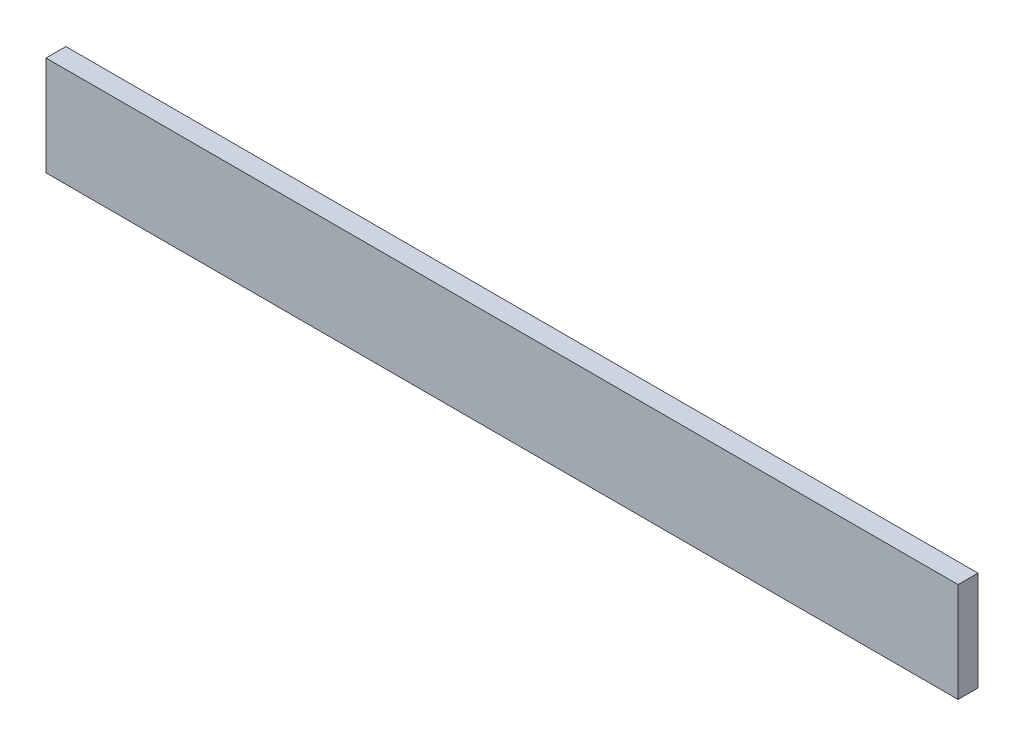
ISO-10303-21;
HEADER;
FILE_DESCRIPTION(('STEP AP214'),'2;1');
FILE_NAME('part.step','',(''),(''),'','','');
FILE_SCHEMA(('AUTOMOTIVE_DESIGN { 1 0 10303 214 1 1 1 1 }'));
ENDSEC;
DATA;
#1=APPLICATION_CONTEXT('core data for automotive mechanical design processes');
#2=APPLICATION_PROTOCOL_DEFINITION('international standard','automotive_design',2000,#1);
#3=PRODUCT_CONTEXT('',#1,'mechanical');
#4=PRODUCT('Part','Part','',(#3));
#5=PRODUCT_RELATED_PRODUCT_CATEGORY('part','',(#4));
#6=PRODUCT_DEFINITION_FORMATION('','',#4);
#7=PRODUCT_DEFINITION_CONTEXT('part definition',#1,'design');
#8=PRODUCT_DEFINITION('design','',#6,#7);
#9=PRODUCT_DEFINITION_SHAPE('','',#8);
#10=(LENGTH_UNIT() NAMED_UNIT(*) SI_UNIT(.MILLI.,.METRE.));
#11=(NAMED_UNIT(*) PLANE_ANGLE_UNIT() SI_UNIT($,.RADIAN.));
#12=(NAMED_UNIT(*) SI_UNIT($,.STERADIAN.) SOLID_ANGLE_UNIT());
#13=UNCERTAINTY_MEASURE_WITH_UNIT(LENGTH_MEASURE(1.E-05),#10,'distance_accuracy_value','');
#14=(GEOMETRIC_REPRESENTATION_CONTEXT(3) GLOBAL_UNCERTAINTY_ASSIGNED_CONTEXT((#13)) GLOBAL_UNIT_ASSIGNED_CONTEXT((#10,
#11,#12)) REPRESENTATION_CONTEXT('',''));
#15=CARTESIAN_POINT('',(0.,0.,0.));
#16=DIRECTION('',(0.,0.,1.));
#17=DIRECTION('',(1.,0.,0.));
#18=AXIS2_PLACEMENT_3D('',#15,#16,#17);
#19=CARTESIAN_POINT('',(0.,0.,10.));
#20=DIRECTION('',(1.,0.,0.));
#21=DIRECTION('',(0.,0.,-1.));
#22=AXIS2_PLACEMENT_3D('',#19,#20,#21);
#23=PLANE('',#22);
#24=DIRECTION('',(0.,-1.,0.));
#25=VECTOR('',#24,1.);
#26=CARTESIAN_POINT('',(0.,0.,0.));
#27=LINE('',#26,#25);
#28=CARTESIAN_POINT('',(0.,50.,0.));
#29=VERTEX_POINT('',#28);
#30=CARTESIAN_POINT('',(0.,0.,0.));
#31=VERTEX_POINT('',#30);
#32=EDGE_CURVE('E98',#29,#31,#27,.T.);
#33=ORIENTED_EDGE('',*,*,#32,.T.);
#34=DIRECTION('',(0.,0.,-1.));
#35=VECTOR('',#34,1.);
#36=CARTESIAN_POINT('',(0.,0.,10.));
#37=LINE('',#36,#35);
#38=CARTESIAN_POINT('',(0.,0.,10.));
#39=VERTEX_POINT('',#38);
#40=EDGE_CURVE('E11',#39,#31,#37,.T.);
#41=ORIENTED_EDGE('',*,*,#40,.F.);
#42=DIRECTION('',(0.,-1.,0.));
#43=VECTOR('',#42,1.);
#44=CARTESIAN_POINT('',(0.,0.,10.));
#45=LINE('',#44,#43);
#46=CARTESIAN_POINT('',(0.,50.,10.));
#47=VERTEX_POINT('',#46);
#48=EDGE_CURVE('E86',#47,#39,#45,.T.);
#49=ORIENTED_EDGE('',*,*,#48,.F.);
#50=DIRECTION('',(0.,0.,-1.));
#51=VECTOR('',#50,1.);
#52=CARTESIAN_POINT('',(0.,50.,10.));
#53=LINE('',#52,#51);
#54=EDGE_CURVE('E94',#47,#29,#53,.T.);
#55=ORIENTED_EDGE('',*,*,#54,.T.);
#56=EDGE_LOOP('',(#33,#41,#49,#55));
#57=FACE_BOUND('',#56,.T.);
#58=ADVANCED_FACE('F35',(#57),#23,.F.);
#59=CARTESIAN_POINT('',(0.,0.,10.));
#60=DIRECTION('',(0.,1.,0.));
#61=DIRECTION('',(0.,0.,1.));
#62=AXIS2_PLACEMENT_3D('',#59,#60,#61);
#63=PLANE('',#62);
#64=DIRECTION('',(1.,0.,0.));
#65=VECTOR('',#64,1.);
#66=CARTESIAN_POINT('',(0.,0.,0.));
#67=LINE('',#66,#65);
#68=CARTESIAN_POINT('',(458.407253025923,0.,0.));
#69=VERTEX_POINT('',#68);
#70=EDGE_CURVE('E90',#31,#69,#67,.T.);
#71=ORIENTED_EDGE('',*,*,#70,.T.);
#72=DIRECTION('',(0.,0.,-1.));
#73=VECTOR('',#72,1.);
#74=CARTESIAN_POINT('',(458.407253025923,0.,10.));
#75=LINE('',#74,#73);
#76=CARTESIAN_POINT('',(458.407253025923,0.,10.));
#77=VERTEX_POINT('',#76);
#78=EDGE_CURVE('E43',#77,#69,#75,.T.);
#79=ORIENTED_EDGE('',*,*,#78,.F.);
#80=DIRECTION('',(1.,0.,0.));
#81=VECTOR('',#80,1.);
#82=CARTESIAN_POINT('',(0.,0.,10.));
#83=LINE('',#82,#81);
#84=EDGE_CURVE('E81',#39,#77,#83,.T.);
#85=ORIENTED_EDGE('',*,*,#84,.F.);
#86=ORIENTED_EDGE('',*,*,#40,.T.);
#87=EDGE_LOOP('',(#71,#79,#85,#86));
#88=FACE_BOUND('',#87,.T.);
#89=ADVANCED_FACE('F89',(#88),#63,.F.);
#90=CARTESIAN_POINT('',(458.407253025923,0.,10.));
#91=DIRECTION('',(-1.,0.,0.));
#92=DIRECTION('',(0.,0.,1.));
#93=AXIS2_PLACEMENT_3D('',#90,#91,#92);
#94=PLANE('',#93);
#95=DIRECTION('',(0.,1.,0.));
#96=VECTOR('',#95,1.);
#97=CARTESIAN_POINT('',(458.407253025923,0.,0.));
#98=LINE('',#97,#96);
#99=CARTESIAN_POINT('',(458.407253025923,50.,0.));
#100=VERTEX_POINT('',#99);
#101=EDGE_CURVE('E68',#69,#100,#98,.T.);
#102=ORIENTED_EDGE('',*,*,#101,.T.);
#103=DIRECTION('',(0.,0.,-1.));
#104=VECTOR('',#103,1.);
#105=CARTESIAN_POINT('',(458.407253025923,50.,10.));
#106=LINE('',#105,#104);
#107=CARTESIAN_POINT('',(458.407253025923,50.,10.));
#108=VERTEX_POINT('',#107);
#109=EDGE_CURVE('E91',#108,#100,#106,.T.);
#110=ORIENTED_EDGE('',*,*,#109,.F.);
#111=DIRECTION('',(0.,1.,0.));
#112=VECTOR('',#111,1.);
#113=CARTESIAN_POINT('',(458.407253025923,0.,10.));
#114=LINE('',#113,#112);
#115=EDGE_CURVE('E84',#77,#108,#114,.T.);
#116=ORIENTED_EDGE('',*,*,#115,.F.);
#117=ORIENTED_EDGE('',*,*,#78,.T.);
#118=EDGE_LOOP('',(#102,#110,#116,#117));
#119=FACE_BOUND('',#118,.T.);
#120=ADVANCED_FACE('F92',(#119),#94,.F.);
#121=CARTESIAN_POINT('',(0.,50.,10.));
#122=DIRECTION('',(0.,-1.,0.));
#123=DIRECTION('',(0.,0.,-1.));
#124=AXIS2_PLACEMENT_3D('',#121,#122,#123);
#125=PLANE('',#124);
#126=DIRECTION('',(-1.,0.,0.));
#127=VECTOR('',#126,1.);
#128=CARTESIAN_POINT('',(0.,50.,0.));
#129=LINE('',#128,#127);
#130=EDGE_CURVE('E74',#100,#29,#129,.T.);
#131=ORIENTED_EDGE('',*,*,#130,.T.);
#132=ORIENTED_EDGE('',*,*,#54,.F.);
#133=DIRECTION('',(-1.,0.,0.));
#134=VECTOR('',#133,1.);
#135=CARTESIAN_POINT('',(0.,50.,10.));
#136=LINE('',#135,#134);
#137=EDGE_CURVE('E51',#108,#47,#136,.T.);
#138=ORIENTED_EDGE('',*,*,#137,.F.);
#139=ORIENTED_EDGE('',*,*,#109,.T.);
#140=EDGE_LOOP('',(#131,#132,#138,#139));
#141=FACE_BOUND('',#140,.T.);
#142=ADVANCED_FACE('F105',(#141),#125,.F.);
#143=CARTESIAN_POINT('',(0.,0.,10.));
#144=DIRECTION('',(0.,0.,-1.));
#145=DIRECTION('',(-1.,0.,0.));
#146=AXIS2_PLACEMENT_3D('',#143,#144,#145);
#147=PLANE('',#146);
#148=ORIENTED_EDGE('',*,*,#48,.T.);
#149=ORIENTED_EDGE('',*,*,#84,.T.);
#150=ORIENTED_EDGE('',*,*,#115,.T.);
#151=ORIENTED_EDGE('',*,*,#137,.T.);
#152=EDGE_LOOP('',(#148,#149,#150,#151));
#153=FACE_BOUND('',#152,.T.);
#154=ADVANCED_FACE('F82',(#153),#147,.F.);
#155=CARTESIAN_POINT('',(0.,0.,0.));
#156=DIRECTION('',(0.,0.,-1.));
#157=DIRECTION('',(-1.,0.,0.));
#158=AXIS2_PLACEMENT_3D('',#155,#156,#157);
#159=PLANE('',#158);
#160=ORIENTED_EDGE('',*,*,#32,.F.);
#161=ORIENTED_EDGE('',*,*,#130,.F.);
#162=ORIENTED_EDGE('',*,*,#101,.F.);
#163=ORIENTED_EDGE('',*,*,#70,.F.);
#164=EDGE_LOOP('',(#160,#161,#162,#163));
#165=FACE_BOUND('',#164,.T.);
#166=ADVANCED_FACE('F108',(#165),#159,.T.);
#167=CLOSED_SHELL('',(#58,#89,#120,#142,#154,#166));
#168=MANIFOLD_SOLID_BREP('B2',#167);
#169=ADVANCED_BREP_SHAPE_REPRESENTATION('',(#18,#168),#14);
#170=SHAPE_DEFINITION_REPRESENTATION(#9,#169);
ENDSEC;
END-ISO-10303-21;
